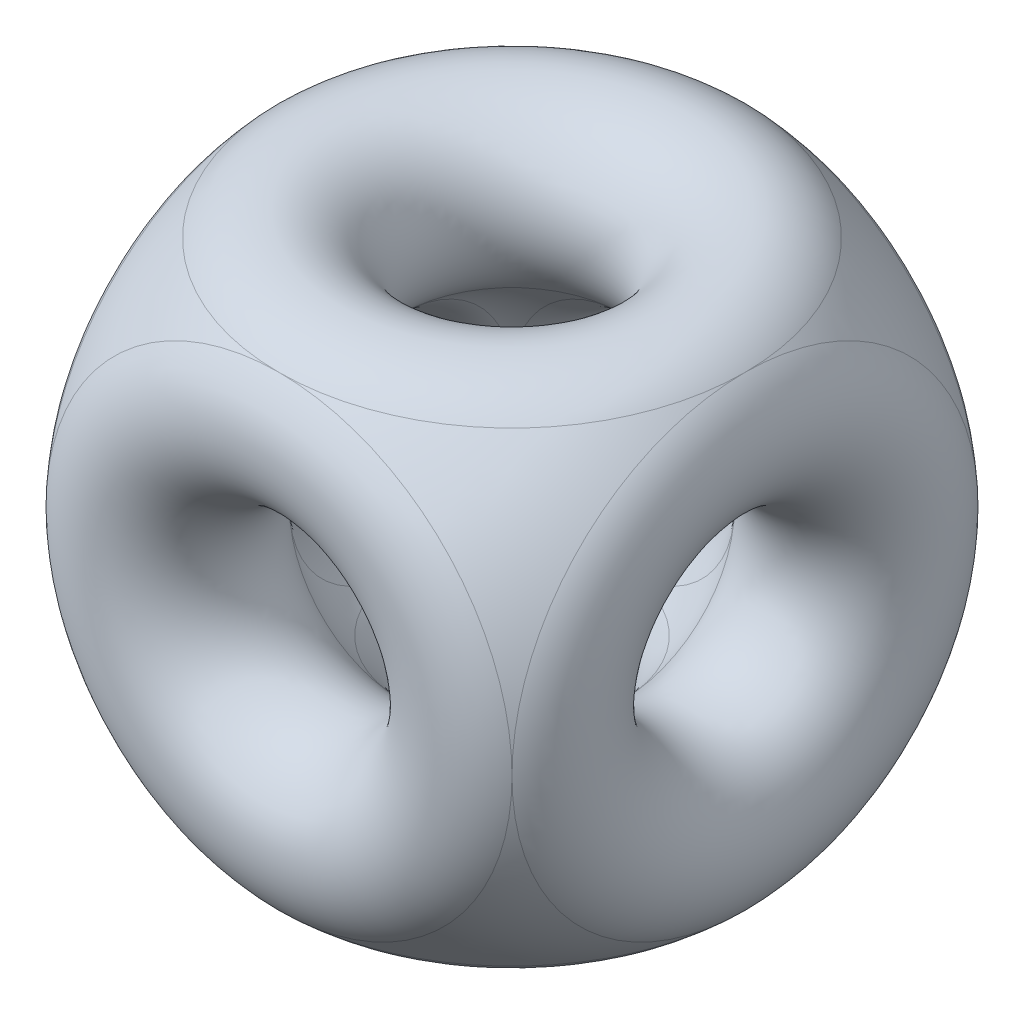
ISO-10303-21;
HEADER;
FILE_DESCRIPTION(('STEP AP214'),'2;1');
FILE_NAME('part.step','',(''),(''),'','','');
FILE_SCHEMA(('AUTOMOTIVE_DESIGN { 1 0 10303 214 1 1 1 1 }'));
ENDSEC;
DATA;
#1=APPLICATION_CONTEXT('core data for automotive mechanical design processes');
#2=APPLICATION_PROTOCOL_DEFINITION('international standard','automotive_design',2000,#1);
#3=PRODUCT_CONTEXT('',#1,'mechanical');
#4=PRODUCT('Part','Part','',(#3));
#5=PRODUCT_RELATED_PRODUCT_CATEGORY('part','',(#4));
#6=PRODUCT_DEFINITION_FORMATION('','',#4);
#7=PRODUCT_DEFINITION_CONTEXT('part definition',#1,'design');
#8=PRODUCT_DEFINITION('design','',#6,#7);
#9=PRODUCT_DEFINITION_SHAPE('','',#8);
#10=(LENGTH_UNIT() NAMED_UNIT(*) SI_UNIT(.MILLI.,.METRE.));
#11=(NAMED_UNIT(*) PLANE_ANGLE_UNIT() SI_UNIT($,.RADIAN.));
#12=(NAMED_UNIT(*) SI_UNIT($,.STERADIAN.) SOLID_ANGLE_UNIT());
#13=UNCERTAINTY_MEASURE_WITH_UNIT(LENGTH_MEASURE(1.E-05),#10,'distance_accuracy_value','');
#14=(GEOMETRIC_REPRESENTATION_CONTEXT(3) GLOBAL_UNCERTAINTY_ASSIGNED_CONTEXT((#13)) GLOBAL_UNIT_ASSIGNED_CONTEXT((#10,
#11,#12)) REPRESENTATION_CONTEXT('',''));
#15=CARTESIAN_POINT('',(0.,0.,0.));
#16=DIRECTION('',(0.,0.,1.));
#17=DIRECTION('',(1.,0.,0.));
#18=AXIS2_PLACEMENT_3D('',#15,#16,#17);
#19=CARTESIAN_POINT('',(0.,0.,0.));
#20=DIRECTION('',(0.,0.,1.));
#21=DIRECTION('',(0.,1.,0.));
#22=AXIS2_PLACEMENT_3D('',#19,#20,#21);
#23=SPHERICAL_SURFACE('',#22,0.914213562373095);
#24=CARTESIAN_POINT('',(-0.646446609406728,0.,0.));
#25=DIRECTION('',(1.,0.,0.));
#26=DIRECTION('',(0.,0.,-1.));
#27=AXIS2_PLACEMENT_3D('',#24,#25,#26);
#28=CIRCLE('',#27,0.646446609406726);
#29=CARTESIAN_POINT('',(-0.646446609406728,0.646446609406726,0.));
#30=VERTEX_POINT('',#29);
#31=CARTESIAN_POINT('',(-0.646446609406728,0.,0.646446609406726));
#32=VERTEX_POINT('',#31);
#33=EDGE_CURVE('E241',#30,#32,#28,.T.);
#34=ORIENTED_EDGE('',*,*,#33,.F.);
#35=CARTESIAN_POINT('',(0.,0.646446609406724,0.));
#36=DIRECTION('',(0.,-1.,0.));
#37=DIRECTION('',(0.,0.,-1.));
#38=AXIS2_PLACEMENT_3D('',#35,#36,#37);
#39=CIRCLE('',#38,0.646446609406726);
#40=CARTESIAN_POINT('',(0.,0.646446609406724,0.646446609406726));
#41=VERTEX_POINT('',#40);
#42=EDGE_CURVE('E135',#41,#30,#39,.T.);
#43=ORIENTED_EDGE('',*,*,#42,.F.);
#44=CARTESIAN_POINT('',(0.,0.,0.646446609406724));
#45=DIRECTION('',(0.,0.,-1.));
#46=DIRECTION('',(-1.,0.,0.));
#47=AXIS2_PLACEMENT_3D('',#44,#45,#46);
#48=CIRCLE('',#47,0.646446609406726);
#49=EDGE_CURVE('E176',#32,#41,#48,.T.);
#50=ORIENTED_EDGE('',*,*,#49,.F.);
#51=EDGE_LOOP('',(#34,#43,#50));
#52=FACE_BOUND('',#51,.T.);
#53=ADVANCED_FACE('F36',(#52),#23,.F.);
#54=CARTESIAN_POINT('',(0.646446609406724,0.,0.646446609406726));
#55=VERTEX_POINT('',#54);
#56=EDGE_CURVE('E143',#41,#55,#48,.T.);
#57=ORIENTED_EDGE('',*,*,#56,.F.);
#58=CARTESIAN_POINT('',(0.646446609406726,0.646446609406723,0.));
#59=VERTEX_POINT('',#58);
#60=EDGE_CURVE('E127',#59,#41,#39,.T.);
#61=ORIENTED_EDGE('',*,*,#60,.F.);
#62=CARTESIAN_POINT('',(0.646446609406724,0.,0.));
#63=DIRECTION('',(1.,0.,0.));
#64=DIRECTION('',(0.,0.,-1.));
#65=AXIS2_PLACEMENT_3D('',#62,#63,#64);
#66=CIRCLE('',#65,0.646446609406726);
#67=EDGE_CURVE('E141',#59,#55,#66,.T.);
#68=ORIENTED_EDGE('',*,*,#67,.T.);
#69=EDGE_LOOP('',(#57,#61,#68));
#70=FACE_BOUND('',#69,.T.);
#71=ADVANCED_FACE('F140',(#70),#23,.F.);
#72=CARTESIAN_POINT('',(0.646446609406726,0.,-0.646446609406728));
#73=VERTEX_POINT('',#72);
#74=EDGE_CURVE('E151',#73,#59,#66,.T.);
#75=ORIENTED_EDGE('',*,*,#74,.T.);
#76=CARTESIAN_POINT('',(0.,0.646446609406724,-0.646446609406726));
#77=VERTEX_POINT('',#76);
#78=EDGE_CURVE('E124',#77,#59,#39,.T.);
#79=ORIENTED_EDGE('',*,*,#78,.F.);
#80=CARTESIAN_POINT('',(0.,0.,-0.646446609406728));
#81=DIRECTION('',(0.,0.,-1.));
#82=DIRECTION('',(-1.,0.,0.));
#83=AXIS2_PLACEMENT_3D('',#80,#81,#82);
#84=CIRCLE('',#83,0.646446609406726);
#85=EDGE_CURVE('E159',#77,#73,#84,.T.);
#86=ORIENTED_EDGE('',*,*,#85,.T.);
#87=EDGE_LOOP('',(#75,#79,#86));
#88=FACE_BOUND('',#87,.T.);
#89=ADVANCED_FACE('F158',(#88),#23,.F.);
#90=CARTESIAN_POINT('',(0.,-0.646446609406728,0.));
#91=DIRECTION('',(0.,-1.,0.));
#92=DIRECTION('',(0.,0.,-1.));
#93=AXIS2_PLACEMENT_3D('',#90,#91,#92);
#94=CIRCLE('',#93,0.646446609406726);
#95=CARTESIAN_POINT('',(0.,-0.646446609406728,0.646446609406726));
#96=VERTEX_POINT('',#95);
#97=CARTESIAN_POINT('',(-0.646446609406726,-0.646446609406728,0.));
#98=VERTEX_POINT('',#97);
#99=EDGE_CURVE('E261',#96,#98,#94,.T.);
#100=ORIENTED_EDGE('',*,*,#99,.T.);
#101=EDGE_CURVE('E177',#32,#98,#28,.T.);
#102=ORIENTED_EDGE('',*,*,#101,.F.);
#103=EDGE_CURVE('E174',#96,#32,#48,.T.);
#104=ORIENTED_EDGE('',*,*,#103,.F.);
#105=EDGE_LOOP('',(#100,#102,#104));
#106=FACE_BOUND('',#105,.T.);
#107=ADVANCED_FACE('F373',(#106),#23,.F.);
#108=CARTESIAN_POINT('',(0.646446609406726,-0.646446609406728,0.));
#109=VERTEX_POINT('',#108);
#110=EDGE_CURVE('E166',#109,#96,#94,.T.);
#111=ORIENTED_EDGE('',*,*,#110,.T.);
#112=EDGE_CURVE('E172',#55,#96,#48,.T.);
#113=ORIENTED_EDGE('',*,*,#112,.F.);
#114=EDGE_CURVE('E154',#55,#109,#66,.T.);
#115=ORIENTED_EDGE('',*,*,#114,.T.);
#116=EDGE_LOOP('',(#111,#113,#115));
#117=FACE_BOUND('',#116,.T.);
#118=ADVANCED_FACE('F169',(#117),#23,.F.);
#119=CARTESIAN_POINT('',(0.,-0.646446609406726,-0.646446609406728));
#120=VERTEX_POINT('',#119);
#121=EDGE_CURVE('E51',#120,#109,#94,.T.);
#122=ORIENTED_EDGE('',*,*,#121,.T.);
#123=EDGE_CURVE('E157',#109,#73,#66,.T.);
#124=ORIENTED_EDGE('',*,*,#123,.T.);
#125=EDGE_CURVE('E207',#73,#120,#84,.T.);
#126=ORIENTED_EDGE('',*,*,#125,.T.);
#127=EDGE_LOOP('',(#122,#124,#126));
#128=FACE_BOUND('',#127,.T.);
#129=ADVANCED_FACE('F290',(#128),#23,.F.);
#130=EDGE_CURVE('E260',#98,#120,#94,.T.);
#131=ORIENTED_EDGE('',*,*,#130,.T.);
#132=CARTESIAN_POINT('',(-0.646446609406728,0.,-0.646446609406726));
#133=VERTEX_POINT('',#132);
#134=EDGE_CURVE('E205',#120,#133,#84,.T.);
#135=ORIENTED_EDGE('',*,*,#134,.T.);
#136=EDGE_CURVE('E297',#98,#133,#28,.T.);
#137=ORIENTED_EDGE('',*,*,#136,.F.);
#138=EDGE_LOOP('',(#131,#135,#137));
#139=FACE_BOUND('',#138,.T.);
#140=ADVANCED_FACE('F284',(#139),#23,.F.);
#141=CARTESIAN_POINT('',(0.,0.,0.));
#142=DIRECTION('',(1.,0.,0.));
#143=DIRECTION('',(0.,-1.,0.));
#144=AXIS2_PLACEMENT_3D('',#141,#142,#143);
#145=SPHERICAL_SURFACE('',#144,1.91421356237309);
#146=CARTESIAN_POINT('',(0.,1.35355339059327,0.));
#147=DIRECTION('',(0.,-1.,0.));
#148=DIRECTION('',(0.,0.,-1.));
#149=AXIS2_PLACEMENT_3D('',#146,#147,#148);
#150=CIRCLE('',#149,1.35355339059327);
#151=CARTESIAN_POINT('',(0.,1.35355339059327,1.35355339059327));
#152=VERTEX_POINT('',#151);
#153=CARTESIAN_POINT('',(-1.35355339059327,1.35355339059327,0.));
#154=VERTEX_POINT('',#153);
#155=EDGE_CURVE('E244',#152,#154,#150,.T.);
#156=ORIENTED_EDGE('',*,*,#155,.T.);
#157=CARTESIAN_POINT('',(-1.35355339059328,0.,0.));
#158=DIRECTION('',(1.,0.,0.));
#159=DIRECTION('',(0.,0.,-1.));
#160=AXIS2_PLACEMENT_3D('',#157,#158,#159);
#161=CIRCLE('',#160,1.35355339059327);
#162=CARTESIAN_POINT('',(-1.35355339059328,0.,1.35355339059327));
#163=VERTEX_POINT('',#162);
#164=EDGE_CURVE('E239',#154,#163,#161,.T.);
#165=ORIENTED_EDGE('',*,*,#164,.T.);
#166=CARTESIAN_POINT('',(0.,0.,1.35355339059327));
#167=DIRECTION('',(0.,0.,-1.));
#168=DIRECTION('',(-1.,0.,0.));
#169=AXIS2_PLACEMENT_3D('',#166,#167,#168);
#170=CIRCLE('',#169,1.35355339059327);
#171=EDGE_CURVE('E184',#163,#152,#170,.T.);
#172=ORIENTED_EDGE('',*,*,#171,.T.);
#173=EDGE_LOOP('',(#156,#165,#172));
#174=FACE_BOUND('',#173,.T.);
#175=ADVANCED_FACE('F267',(#174),#145,.T.);
#176=CARTESIAN_POINT('',(1.35355339059327,1.35355339059327,0.));
#177=VERTEX_POINT('',#176);
#178=EDGE_CURVE('E263',#177,#152,#150,.T.);
#179=ORIENTED_EDGE('',*,*,#178,.T.);
#180=CARTESIAN_POINT('',(1.35355339059327,0.,1.35355339059327));
#181=VERTEX_POINT('',#180);
#182=EDGE_CURVE('E183',#152,#181,#170,.T.);
#183=ORIENTED_EDGE('',*,*,#182,.T.);
#184=CARTESIAN_POINT('',(1.35355339059327,0.,0.));
#185=DIRECTION('',(1.,0.,0.));
#186=DIRECTION('',(0.,0.,-1.));
#187=AXIS2_PLACEMENT_3D('',#184,#185,#186);
#188=CIRCLE('',#187,1.35355339059327);
#189=EDGE_CURVE('E161',#177,#181,#188,.T.);
#190=ORIENTED_EDGE('',*,*,#189,.F.);
#191=EDGE_LOOP('',(#179,#183,#190));
#192=FACE_BOUND('',#191,.T.);
#193=ADVANCED_FACE('F295',(#192),#145,.T.);
#194=CARTESIAN_POINT('',(0.,1.35355339059327,-1.35355339059328));
#195=VERTEX_POINT('',#194);
#196=EDGE_CURVE('E59',#195,#177,#150,.T.);
#197=ORIENTED_EDGE('',*,*,#196,.T.);
#198=CARTESIAN_POINT('',(1.35355339059327,0.,-1.35355339059327));
#199=VERTEX_POINT('',#198);
#200=EDGE_CURVE('E163',#199,#177,#188,.T.);
#201=ORIENTED_EDGE('',*,*,#200,.F.);
#202=CARTESIAN_POINT('',(0.,0.,-1.35355339059328));
#203=DIRECTION('',(0.,0.,-1.));
#204=DIRECTION('',(-1.,0.,0.));
#205=AXIS2_PLACEMENT_3D('',#202,#203,#204);
#206=CIRCLE('',#205,1.35355339059327);
#207=EDGE_CURVE('E197',#195,#199,#206,.T.);
#208=ORIENTED_EDGE('',*,*,#207,.F.);
#209=EDGE_LOOP('',(#197,#201,#208));
#210=FACE_BOUND('',#209,.T.);
#211=ADVANCED_FACE('F247',(#210),#145,.T.);
#212=CARTESIAN_POINT('',(-1.35355339059327,0.,0.));
#213=DIRECTION('',(1.,0.,0.));
#214=DIRECTION('',(0.,0.,-1.));
#215=AXIS2_PLACEMENT_3D('',#212,#213,#214);
#216=CIRCLE('',#215,1.35355339059327);
#217=CARTESIAN_POINT('',(-1.35355339059327,-1.35355339059327,0.));
#218=VERTEX_POINT('',#217);
#219=EDGE_CURVE('E11',#163,#218,#216,.T.);
#220=ORIENTED_EDGE('',*,*,#219,.T.);
#221=CARTESIAN_POINT('',(0.,-1.35355339059328,0.));
#222=DIRECTION('',(0.,-1.,0.));
#223=DIRECTION('',(0.,0.,-1.));
#224=AXIS2_PLACEMENT_3D('',#221,#222,#223);
#225=CIRCLE('',#224,1.35355339059327);
#226=CARTESIAN_POINT('',(0.,-1.35355339059328,1.35355339059327));
#227=VERTEX_POINT('',#226);
#228=EDGE_CURVE('E262',#227,#218,#225,.T.);
#229=ORIENTED_EDGE('',*,*,#228,.F.);
#230=EDGE_CURVE('E180',#227,#163,#170,.T.);
#231=ORIENTED_EDGE('',*,*,#230,.T.);
#232=EDGE_LOOP('',(#220,#229,#231));
#233=FACE_BOUND('',#232,.T.);
#234=ADVANCED_FACE('F419',(#233),#145,.T.);
#235=EDGE_CURVE('E182',#181,#227,#170,.T.);
#236=ORIENTED_EDGE('',*,*,#235,.T.);
#237=CARTESIAN_POINT('',(1.35355339059327,-1.35355339059328,0.));
#238=VERTEX_POINT('',#237);
#239=EDGE_CURVE('E258',#238,#227,#225,.T.);
#240=ORIENTED_EDGE('',*,*,#239,.F.);
#241=CARTESIAN_POINT('',(1.35355339059327,0.,0.));
#242=DIRECTION('',(1.,0.,0.));
#243=DIRECTION('',(0.,0.,-1.));
#244=AXIS2_PLACEMENT_3D('',#241,#242,#243);
#245=CIRCLE('',#244,1.35355339059327);
#246=EDGE_CURVE('E220',#181,#238,#245,.T.);
#247=ORIENTED_EDGE('',*,*,#246,.F.);
#248=EDGE_LOOP('',(#236,#240,#247));
#249=FACE_BOUND('',#248,.T.);
#250=ADVANCED_FACE('F427',(#249),#145,.T.);
#251=EDGE_CURVE('E215',#238,#199,#245,.T.);
#252=ORIENTED_EDGE('',*,*,#251,.F.);
#253=CARTESIAN_POINT('',(0.,-1.35355339059327,-1.35355339059327));
#254=VERTEX_POINT('',#253);
#255=EDGE_CURVE('E255',#254,#238,#225,.T.);
#256=ORIENTED_EDGE('',*,*,#255,.F.);
#257=EDGE_CURVE('E196',#199,#254,#206,.T.);
#258=ORIENTED_EDGE('',*,*,#257,.F.);
#259=EDGE_LOOP('',(#252,#256,#258));
#260=FACE_BOUND('',#259,.T.);
#261=ADVANCED_FACE('F254',(#260),#145,.T.);
#262=CARTESIAN_POINT('',(-1.35355339059327,0.,-1.35355339059327));
#263=VERTEX_POINT('',#262);
#264=EDGE_CURVE('E192',#254,#263,#206,.T.);
#265=ORIENTED_EDGE('',*,*,#264,.F.);
#266=EDGE_CURVE('E231',#218,#254,#225,.T.);
#267=ORIENTED_EDGE('',*,*,#266,.F.);
#268=EDGE_CURVE('E44',#218,#263,#216,.T.);
#269=ORIENTED_EDGE('',*,*,#268,.T.);
#270=EDGE_LOOP('',(#265,#267,#269));
#271=FACE_BOUND('',#270,.T.);
#272=ADVANCED_FACE('F230',(#271),#145,.T.);
#273=EDGE_CURVE('E208',#133,#77,#84,.T.);
#274=ORIENTED_EDGE('',*,*,#273,.T.);
#275=EDGE_CURVE('E130',#30,#77,#39,.T.);
#276=ORIENTED_EDGE('',*,*,#275,.F.);
#277=EDGE_CURVE('E469',#133,#30,#28,.T.);
#278=ORIENTED_EDGE('',*,*,#277,.F.);
#279=EDGE_LOOP('',(#274,#276,#278));
#280=FACE_BOUND('',#279,.T.);
#281=ADVANCED_FACE('F277',(#280),#23,.F.);
#282=EDGE_CURVE('E145',#154,#195,#150,.T.);
#283=ORIENTED_EDGE('',*,*,#282,.T.);
#284=EDGE_CURVE('E198',#263,#195,#206,.T.);
#285=ORIENTED_EDGE('',*,*,#284,.F.);
#286=EDGE_CURVE('E236',#263,#154,#161,.T.);
#287=ORIENTED_EDGE('',*,*,#286,.T.);
#288=EDGE_LOOP('',(#283,#285,#287));
#289=FACE_BOUND('',#288,.T.);
#290=ADVANCED_FACE('F38',(#289),#145,.T.);
#291=CARTESIAN_POINT('',(0.,0.,-1.));
#292=DIRECTION('',(0.,0.,1.));
#293=DIRECTION('',(-1.,0.,0.));
#294=AXIS2_PLACEMENT_3D('',#291,#292,#293);
#295=TOROIDAL_SURFACE('',#294,1.,0.500000000000001);
#296=ORIENTED_EDGE('',*,*,#284,.T.);
#297=ORIENTED_EDGE('',*,*,#207,.T.);
#298=ORIENTED_EDGE('',*,*,#257,.T.);
#299=ORIENTED_EDGE('',*,*,#264,.T.);
#300=EDGE_LOOP('',(#296,#297,#298,#299));
#301=FACE_BOUND('',#300,.T.);
#302=ORIENTED_EDGE('',*,*,#273,.F.);
#303=ORIENTED_EDGE('',*,*,#134,.F.);
#304=ORIENTED_EDGE('',*,*,#125,.F.);
#305=ORIENTED_EDGE('',*,*,#85,.F.);
#306=EDGE_LOOP('',(#302,#303,#304,#305));
#307=FACE_BOUND('',#306,.T.);
#308=ADVANCED_FACE('F250',(#301,#307),#295,.T.);
#309=CARTESIAN_POINT('',(0.,0.,0.999999999999997));
#310=DIRECTION('',(0.,0.,1.));
#311=DIRECTION('',(-1.,0.,0.));
#312=AXIS2_PLACEMENT_3D('',#309,#310,#311);
#313=TOROIDAL_SURFACE('',#312,1.,0.499999999999999);
#314=ORIENTED_EDGE('',*,*,#49,.T.);
#315=ORIENTED_EDGE('',*,*,#56,.T.);
#316=ORIENTED_EDGE('',*,*,#112,.T.);
#317=ORIENTED_EDGE('',*,*,#103,.T.);
#318=EDGE_LOOP('',(#314,#315,#316,#317));
#319=FACE_BOUND('',#318,.T.);
#320=ORIENTED_EDGE('',*,*,#171,.F.);
#321=ORIENTED_EDGE('',*,*,#230,.F.);
#322=ORIENTED_EDGE('',*,*,#235,.F.);
#323=ORIENTED_EDGE('',*,*,#182,.F.);
#324=EDGE_LOOP('',(#320,#321,#322,#323));
#325=FACE_BOUND('',#324,.T.);
#326=ADVANCED_FACE('F301',(#319,#325),#313,.T.);
#327=CARTESIAN_POINT('',(0.999999999999997,0.,0.));
#328=DIRECTION('',(1.,0.,0.));
#329=DIRECTION('',(0.,0.,-1.));
#330=AXIS2_PLACEMENT_3D('',#327,#328,#329);
#331=TOROIDAL_SURFACE('',#330,1.,0.499999999999999);
#332=ORIENTED_EDGE('',*,*,#74,.F.);
#333=ORIENTED_EDGE('',*,*,#123,.F.);
#334=ORIENTED_EDGE('',*,*,#114,.F.);
#335=ORIENTED_EDGE('',*,*,#67,.F.);
#336=EDGE_LOOP('',(#332,#333,#334,#335));
#337=FACE_BOUND('',#336,.T.);
#338=ORIENTED_EDGE('',*,*,#200,.T.);
#339=ORIENTED_EDGE('',*,*,#189,.T.);
#340=ORIENTED_EDGE('',*,*,#246,.T.);
#341=ORIENTED_EDGE('',*,*,#251,.T.);
#342=EDGE_LOOP('',(#338,#339,#340,#341));
#343=FACE_BOUND('',#342,.T.);
#344=ADVANCED_FACE('F148',(#337,#343),#331,.T.);
#345=CARTESIAN_POINT('',(-1.,0.,0.));
#346=DIRECTION('',(1.,0.,0.));
#347=DIRECTION('',(0.,0.,-1.));
#348=AXIS2_PLACEMENT_3D('',#345,#346,#347);
#349=TOROIDAL_SURFACE('',#348,1.,0.500000000000001);
#350=ORIENTED_EDGE('',*,*,#286,.F.);
#351=ORIENTED_EDGE('',*,*,#268,.F.);
#352=ORIENTED_EDGE('',*,*,#219,.F.);
#353=ORIENTED_EDGE('',*,*,#164,.F.);
#354=EDGE_LOOP('',(#350,#351,#352,#353));
#355=FACE_BOUND('',#354,.T.);
#356=ORIENTED_EDGE('',*,*,#277,.T.);
#357=ORIENTED_EDGE('',*,*,#33,.T.);
#358=ORIENTED_EDGE('',*,*,#101,.T.);
#359=ORIENTED_EDGE('',*,*,#136,.T.);
#360=EDGE_LOOP('',(#356,#357,#358,#359));
#361=FACE_BOUND('',#360,.T.);
#362=ADVANCED_FACE('F237',(#355,#361),#349,.T.);
#363=CARTESIAN_POINT('',(0.,-1.,0.));
#364=DIRECTION('',(0.,1.,0.));
#365=DIRECTION('',(0.,0.,-1.));
#366=AXIS2_PLACEMENT_3D('',#363,#364,#365);
#367=TOROIDAL_SURFACE('',#366,1.,0.500000000000001);
#368=ORIENTED_EDGE('',*,*,#255,.T.);
#369=ORIENTED_EDGE('',*,*,#239,.T.);
#370=ORIENTED_EDGE('',*,*,#228,.T.);
#371=ORIENTED_EDGE('',*,*,#266,.T.);
#372=EDGE_LOOP('',(#368,#369,#370,#371));
#373=FACE_BOUND('',#372,.T.);
#374=ORIENTED_EDGE('',*,*,#110,.F.);
#375=ORIENTED_EDGE('',*,*,#121,.F.);
#376=ORIENTED_EDGE('',*,*,#130,.F.);
#377=ORIENTED_EDGE('',*,*,#99,.F.);
#378=EDGE_LOOP('',(#374,#375,#376,#377));
#379=FACE_BOUND('',#378,.T.);
#380=ADVANCED_FACE('F269',(#373,#379),#367,.T.);
#381=CARTESIAN_POINT('',(0.,0.999999999999997,0.));
#382=DIRECTION('',(0.,1.,0.));
#383=DIRECTION('',(0.,0.,-1.));
#384=AXIS2_PLACEMENT_3D('',#381,#382,#383);
#385=TOROIDAL_SURFACE('',#384,1.,0.499999999999999);
#386=ORIENTED_EDGE('',*,*,#60,.T.);
#387=ORIENTED_EDGE('',*,*,#42,.T.);
#388=ORIENTED_EDGE('',*,*,#275,.T.);
#389=ORIENTED_EDGE('',*,*,#78,.T.);
#390=EDGE_LOOP('',(#386,#387,#388,#389));
#391=FACE_BOUND('',#390,.T.);
#392=ORIENTED_EDGE('',*,*,#196,.F.);
#393=ORIENTED_EDGE('',*,*,#282,.F.);
#394=ORIENTED_EDGE('',*,*,#155,.F.);
#395=ORIENTED_EDGE('',*,*,#178,.F.);
#396=EDGE_LOOP('',(#392,#393,#394,#395));
#397=FACE_BOUND('',#396,.T.);
#398=ADVANCED_FACE('F126',(#391,#397),#385,.T.);
#399=CLOSED_SHELL('',(#53,#71,#89,#107,#118,#129,#140,#175,#193,#211,#234,#250,#261,#272,#281,
#290,#308,#326,#344,#362,#380,#398));
#400=MANIFOLD_SOLID_BREP('B2',#399);
#401=ADVANCED_BREP_SHAPE_REPRESENTATION('',(#18,#400),#14);
#402=SHAPE_DEFINITION_REPRESENTATION(#9,#401);
ENDSEC;
END-ISO-10303-21;
